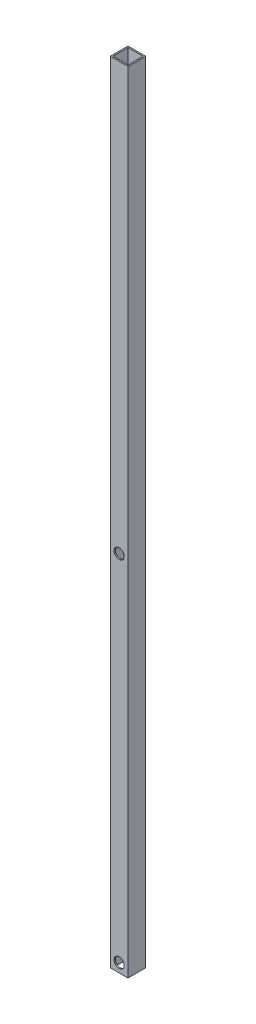
ISO-10303-21;
HEADER;
FILE_DESCRIPTION(('STEP AP214'),'2;1');
FILE_NAME('part.step','',(''),(''),'','','');
FILE_SCHEMA(('AUTOMOTIVE_DESIGN { 1 0 10303 214 1 1 1 1 }'));
ENDSEC;
DATA;
#1=APPLICATION_CONTEXT('core data for automotive mechanical design processes');
#2=APPLICATION_PROTOCOL_DEFINITION('international standard','automotive_design',2000,#1);
#3=PRODUCT_CONTEXT('',#1,'mechanical');
#4=PRODUCT('Part','Part','',(#3));
#5=PRODUCT_RELATED_PRODUCT_CATEGORY('part','',(#4));
#6=PRODUCT_DEFINITION_FORMATION('','',#4);
#7=PRODUCT_DEFINITION_CONTEXT('part definition',#1,'design');
#8=PRODUCT_DEFINITION('design','',#6,#7);
#9=PRODUCT_DEFINITION_SHAPE('','',#8);
#10=(LENGTH_UNIT() NAMED_UNIT(*) SI_UNIT(.MILLI.,.METRE.));
#11=(NAMED_UNIT(*) PLANE_ANGLE_UNIT() SI_UNIT($,.RADIAN.));
#12=(NAMED_UNIT(*) SI_UNIT($,.STERADIAN.) SOLID_ANGLE_UNIT());
#13=UNCERTAINTY_MEASURE_WITH_UNIT(LENGTH_MEASURE(1.E-05),#10,'distance_accuracy_value','');
#14=(GEOMETRIC_REPRESENTATION_CONTEXT(3) GLOBAL_UNCERTAINTY_ASSIGNED_CONTEXT((#13)) GLOBAL_UNIT_ASSIGNED_CONTEXT((#10,
#11,#12)) REPRESENTATION_CONTEXT('',''));
#15=CARTESIAN_POINT('',(0.,0.,0.));
#16=DIRECTION('',(0.,0.,1.));
#17=DIRECTION('',(1.,0.,0.));
#18=AXIS2_PLACEMENT_3D('',#15,#16,#17);
#19=CARTESIAN_POINT('',(0.,1981.2,0.));
#20=DIRECTION('',(0.,-1.,0.));
#21=DIRECTION('',(0.,0.,1.));
#22=AXIS2_PLACEMENT_3D('',#19,#20,#21);
#23=PLANE('',#22);
#24=DIRECTION('',(0.,0.,-1.));
#25=VECTOR('',#24,1.);
#26=CARTESIAN_POINT('',(0.,1981.2,0.));
#27=LINE('',#26,#25);
#28=CARTESIAN_POINT('',(0.,1981.2,44.45));
#29=VERTEX_POINT('',#28);
#30=CARTESIAN_POINT('',(0.,1981.2,0.));
#31=VERTEX_POINT('',#30);
#32=EDGE_CURVE('E140',#29,#31,#27,.T.);
#33=ORIENTED_EDGE('',*,*,#32,.F.);
#34=DIRECTION('',(-1.,0.,0.));
#35=VECTOR('',#34,1.);
#36=CARTESIAN_POINT('',(0.,1981.2,44.45));
#37=LINE('',#36,#35);
#38=CARTESIAN_POINT('',(44.45,1981.2,44.45));
#39=VERTEX_POINT('',#38);
#40=EDGE_CURVE('E150',#39,#29,#37,.T.);
#41=ORIENTED_EDGE('',*,*,#40,.F.);
#42=DIRECTION('',(0.,0.,1.));
#43=VECTOR('',#42,1.);
#44=CARTESIAN_POINT('',(44.45,1981.2,0.));
#45=LINE('',#44,#43);
#46=CARTESIAN_POINT('',(44.45,1981.2,0.));
#47=VERTEX_POINT('',#46);
#48=EDGE_CURVE('E147',#47,#39,#45,.T.);
#49=ORIENTED_EDGE('',*,*,#48,.F.);
#50=DIRECTION('',(1.,0.,0.));
#51=VECTOR('',#50,1.);
#52=CARTESIAN_POINT('',(0.,1981.2,0.));
#53=LINE('',#52,#51);
#54=EDGE_CURVE('E143',#31,#47,#53,.T.);
#55=ORIENTED_EDGE('',*,*,#54,.F.);
#56=EDGE_LOOP('',(#33,#41,#49,#55));
#57=FACE_BOUND('',#56,.T.);
#58=DIRECTION('',(1.,0.,0.));
#59=VECTOR('',#58,1.);
#60=CARTESIAN_POINT('',(3.175,1981.2,3.175));
#61=LINE('',#60,#59);
#62=CARTESIAN_POINT('',(3.175,1981.2,3.175));
#63=VERTEX_POINT('',#62);
#64=CARTESIAN_POINT('',(41.275,1981.2,3.175));
#65=VERTEX_POINT('',#64);
#66=EDGE_CURVE('E104',#63,#65,#61,.T.);
#67=ORIENTED_EDGE('',*,*,#66,.T.);
#68=DIRECTION('',(0.,0.,1.));
#69=VECTOR('',#68,1.);
#70=CARTESIAN_POINT('',(41.275,1981.2,3.175));
#71=LINE('',#70,#69);
#72=CARTESIAN_POINT('',(41.275,1981.2,41.275));
#73=VERTEX_POINT('',#72);
#74=EDGE_CURVE('E113',#65,#73,#71,.T.);
#75=ORIENTED_EDGE('',*,*,#74,.T.);
#76=DIRECTION('',(-1.,0.,0.));
#77=VECTOR('',#76,1.);
#78=CARTESIAN_POINT('',(3.175,1981.2,41.275));
#79=LINE('',#78,#77);
#80=CARTESIAN_POINT('',(3.175,1981.2,41.275));
#81=VERTEX_POINT('',#80);
#82=EDGE_CURVE('E117',#73,#81,#79,.T.);
#83=ORIENTED_EDGE('',*,*,#82,.T.);
#84=DIRECTION('',(0.,0.,-1.));
#85=VECTOR('',#84,1.);
#86=CARTESIAN_POINT('',(3.175,1981.2,3.175));
#87=LINE('',#86,#85);
#88=EDGE_CURVE('E120',#81,#63,#87,.T.);
#89=ORIENTED_EDGE('',*,*,#88,.T.);
#90=EDGE_LOOP('',(#67,#75,#83,#89));
#91=FACE_BOUND('',#90,.T.);
#92=ADVANCED_FACE('F37',(#57,#91),#23,.F.);
#93=CARTESIAN_POINT('',(0.,0.,0.));
#94=DIRECTION('',(0.,-1.,0.));
#95=DIRECTION('',(0.,0.,1.));
#96=AXIS2_PLACEMENT_3D('',#93,#94,#95);
#97=PLANE('',#96);
#98=DIRECTION('',(0.,0.,-1.));
#99=VECTOR('',#98,1.);
#100=CARTESIAN_POINT('',(0.,0.,0.));
#101=LINE('',#100,#99);
#102=CARTESIAN_POINT('',(0.,0.,44.45));
#103=VERTEX_POINT('',#102);
#104=CARTESIAN_POINT('',(0.,0.,0.));
#105=VERTEX_POINT('',#104);
#106=EDGE_CURVE('E109',#103,#105,#101,.T.);
#107=ORIENTED_EDGE('',*,*,#106,.T.);
#108=DIRECTION('',(1.,0.,0.));
#109=VECTOR('',#108,1.);
#110=CARTESIAN_POINT('',(0.,0.,0.));
#111=LINE('',#110,#109);
#112=CARTESIAN_POINT('',(44.45,0.,0.));
#113=VERTEX_POINT('',#112);
#114=EDGE_CURVE('E156',#105,#113,#111,.T.);
#115=ORIENTED_EDGE('',*,*,#114,.T.);
#116=DIRECTION('',(0.,0.,1.));
#117=VECTOR('',#116,1.);
#118=CARTESIAN_POINT('',(44.45,0.,0.));
#119=LINE('',#118,#117);
#120=CARTESIAN_POINT('',(44.45,0.,44.45));
#121=VERTEX_POINT('',#120);
#122=EDGE_CURVE('E159',#113,#121,#119,.T.);
#123=ORIENTED_EDGE('',*,*,#122,.T.);
#124=DIRECTION('',(-1.,0.,0.));
#125=VECTOR('',#124,1.);
#126=CARTESIAN_POINT('',(0.,0.,44.45));
#127=LINE('',#126,#125);
#128=EDGE_CURVE('E144',#121,#103,#127,.T.);
#129=ORIENTED_EDGE('',*,*,#128,.T.);
#130=EDGE_LOOP('',(#107,#115,#123,#129));
#131=FACE_BOUND('',#130,.T.);
#132=DIRECTION('',(0.,0.,-1.));
#133=VECTOR('',#132,1.);
#134=CARTESIAN_POINT('',(3.175,0.,3.175));
#135=LINE('',#134,#133);
#136=CARTESIAN_POINT('',(3.175,0.,41.275));
#137=VERTEX_POINT('',#136);
#138=CARTESIAN_POINT('',(3.175,0.,3.175));
#139=VERTEX_POINT('',#138);
#140=EDGE_CURVE('E121',#137,#139,#135,.T.);
#141=ORIENTED_EDGE('',*,*,#140,.F.);
#142=DIRECTION('',(-1.,0.,0.));
#143=VECTOR('',#142,1.);
#144=CARTESIAN_POINT('',(3.175,0.,41.275));
#145=LINE('',#144,#143);
#146=CARTESIAN_POINT('',(41.275,0.,41.275));
#147=VERTEX_POINT('',#146);
#148=EDGE_CURVE('E124',#147,#137,#145,.T.);
#149=ORIENTED_EDGE('',*,*,#148,.F.);
#150=DIRECTION('',(0.,0.,1.));
#151=VECTOR('',#150,1.);
#152=CARTESIAN_POINT('',(41.275,0.,3.175));
#153=LINE('',#152,#151);
#154=CARTESIAN_POINT('',(41.275,0.,3.175));
#155=VERTEX_POINT('',#154);
#156=EDGE_CURVE('E133',#155,#147,#153,.T.);
#157=ORIENTED_EDGE('',*,*,#156,.F.);
#158=DIRECTION('',(1.,0.,0.));
#159=VECTOR('',#158,1.);
#160=CARTESIAN_POINT('',(3.175,0.,3.175));
#161=LINE('',#160,#159);
#162=EDGE_CURVE('E105',#139,#155,#161,.T.);
#163=ORIENTED_EDGE('',*,*,#162,.F.);
#164=EDGE_LOOP('',(#141,#149,#157,#163));
#165=FACE_BOUND('',#164,.T.);
#166=ADVANCED_FACE('F176',(#131,#165),#97,.T.);
#167=CARTESIAN_POINT('',(0.,1981.2,0.));
#168=DIRECTION('',(1.,0.,0.));
#169=DIRECTION('',(0.,0.,1.));
#170=AXIS2_PLACEMENT_3D('',#167,#168,#169);
#171=PLANE('',#170);
#172=ORIENTED_EDGE('',*,*,#106,.F.);
#173=DIRECTION('',(0.,-1.,0.));
#174=VECTOR('',#173,1.);
#175=CARTESIAN_POINT('',(0.,1981.2,44.45));
#176=LINE('',#175,#174);
#177=EDGE_CURVE('E153',#29,#103,#176,.T.);
#178=ORIENTED_EDGE('',*,*,#177,.F.);
#179=ORIENTED_EDGE('',*,*,#32,.T.);
#180=DIRECTION('',(0.,-1.,0.));
#181=VECTOR('',#180,1.);
#182=CARTESIAN_POINT('',(0.,1981.2,0.));
#183=LINE('',#182,#181);
#184=EDGE_CURVE('E11',#31,#105,#183,.T.);
#185=ORIENTED_EDGE('',*,*,#184,.T.);
#186=EDGE_LOOP('',(#172,#178,#179,#185));
#187=FACE_BOUND('',#186,.T.);
#188=ADVANCED_FACE('F39',(#187),#171,.F.);
#189=CARTESIAN_POINT('',(0.,1981.2,0.));
#190=DIRECTION('',(0.,0.,1.));
#191=DIRECTION('',(-1.,0.,0.));
#192=AXIS2_PLACEMENT_3D('',#189,#190,#191);
#193=PLANE('',#192);
#194=CARTESIAN_POINT('',(22.225,22.225,0.));
#195=DIRECTION('',(0.,0.,1.));
#196=DIRECTION('',(1.,0.,0.));
#197=AXIS2_PLACEMENT_3D('',#194,#195,#196);
#198=CIRCLE('',#197,18.25625);
#199=CARTESIAN_POINT('',(40.48125,22.225,0.));
#200=VERTEX_POINT('',#199);
#201=EDGE_CURVE('E134',#200,#200,#198,.T.);
#202=ORIENTED_EDGE('',*,*,#201,.T.);
#203=EDGE_LOOP('',(#202));
#204=FACE_BOUND('',#203,.T.);
#205=CARTESIAN_POINT('',(22.225,911.225,0.));
#206=DIRECTION('',(0.,0.,1.));
#207=DIRECTION('',(1.,0.,0.));
#208=AXIS2_PLACEMENT_3D('',#205,#206,#207);
#209=CIRCLE('',#208,18.25625);
#210=CARTESIAN_POINT('',(40.48125,911.225,0.));
#211=VERTEX_POINT('',#210);
#212=EDGE_CURVE('E127',#211,#211,#209,.T.);
#213=ORIENTED_EDGE('',*,*,#212,.T.);
#214=EDGE_LOOP('',(#213));
#215=FACE_BOUND('',#214,.T.);
#216=ORIENTED_EDGE('',*,*,#114,.F.);
#217=ORIENTED_EDGE('',*,*,#184,.F.);
#218=ORIENTED_EDGE('',*,*,#54,.T.);
#219=DIRECTION('',(0.,-1.,0.));
#220=VECTOR('',#219,1.);
#221=CARTESIAN_POINT('',(44.45,1981.2,0.));
#222=LINE('',#221,#220);
#223=EDGE_CURVE('E45',#47,#113,#222,.T.);
#224=ORIENTED_EDGE('',*,*,#223,.T.);
#225=EDGE_LOOP('',(#216,#217,#218,#224));
#226=FACE_BOUND('',#225,.T.);
#227=ADVANCED_FACE('F169',(#204,#215,#226),#193,.F.);
#228=CARTESIAN_POINT('',(44.45,1981.2,0.));
#229=DIRECTION('',(-1.,0.,0.));
#230=DIRECTION('',(0.,0.,-1.));
#231=AXIS2_PLACEMENT_3D('',#228,#229,#230);
#232=PLANE('',#231);
#233=ORIENTED_EDGE('',*,*,#122,.F.);
#234=ORIENTED_EDGE('',*,*,#223,.F.);
#235=ORIENTED_EDGE('',*,*,#48,.T.);
#236=DIRECTION('',(0.,-1.,0.));
#237=VECTOR('',#236,1.);
#238=CARTESIAN_POINT('',(44.45,1981.2,44.45));
#239=LINE('',#238,#237);
#240=EDGE_CURVE('E165',#39,#121,#239,.T.);
#241=ORIENTED_EDGE('',*,*,#240,.T.);
#242=EDGE_LOOP('',(#233,#234,#235,#241));
#243=FACE_BOUND('',#242,.T.);
#244=ADVANCED_FACE('F173',(#243),#232,.F.);
#245=CARTESIAN_POINT('',(0.,1981.2,44.45));
#246=DIRECTION('',(0.,0.,-1.));
#247=DIRECTION('',(1.,0.,0.));
#248=AXIS2_PLACEMENT_3D('',#245,#246,#247);
#249=PLANE('',#248);
#250=CARTESIAN_POINT('',(22.225,911.225,44.45));
#251=DIRECTION('',(0.,0.,-1.));
#252=DIRECTION('',(-1.,0.,0.));
#253=AXIS2_PLACEMENT_3D('',#250,#251,#252);
#254=CIRCLE('',#253,12.7);
#255=CARTESIAN_POINT('',(9.525,911.225,44.45));
#256=VERTEX_POINT('',#255);
#257=EDGE_CURVE('E236',#256,#256,#254,.T.);
#258=ORIENTED_EDGE('',*,*,#257,.T.);
#259=EDGE_LOOP('',(#258));
#260=FACE_BOUND('',#259,.T.);
#261=CARTESIAN_POINT('',(22.225,22.225,44.45));
#262=DIRECTION('',(0.,0.,-1.));
#263=DIRECTION('',(-1.,0.,0.));
#264=AXIS2_PLACEMENT_3D('',#261,#262,#263);
#265=CIRCLE('',#264,12.7);
#266=CARTESIAN_POINT('',(9.525,22.225,44.45));
#267=VERTEX_POINT('',#266);
#268=EDGE_CURVE('E240',#267,#267,#265,.T.);
#269=ORIENTED_EDGE('',*,*,#268,.T.);
#270=EDGE_LOOP('',(#269));
#271=FACE_BOUND('',#270,.T.);
#272=ORIENTED_EDGE('',*,*,#128,.F.);
#273=ORIENTED_EDGE('',*,*,#240,.F.);
#274=ORIENTED_EDGE('',*,*,#40,.T.);
#275=ORIENTED_EDGE('',*,*,#177,.T.);
#276=EDGE_LOOP('',(#272,#273,#274,#275));
#277=FACE_BOUND('',#276,.T.);
#278=ADVANCED_FACE('F184',(#260,#271,#277),#249,.F.);
#279=CARTESIAN_POINT('',(3.175,1981.2,3.175));
#280=DIRECTION('',(0.,0.,1.));
#281=DIRECTION('',(-1.,0.,0.));
#282=AXIS2_PLACEMENT_3D('',#279,#280,#281);
#283=PLANE('',#282);
#284=CARTESIAN_POINT('',(22.225,22.225,3.175));
#285=DIRECTION('',(0.,0.,-1.));
#286=DIRECTION('',(-1.,0.,0.));
#287=AXIS2_PLACEMENT_3D('',#284,#285,#286);
#288=CIRCLE('',#287,18.25625);
#289=CARTESIAN_POINT('',(3.96875,22.225,3.175));
#290=VERTEX_POINT('',#289);
#291=EDGE_CURVE('E248',#290,#290,#288,.F.);
#292=ORIENTED_EDGE('',*,*,#291,.F.);
#293=EDGE_LOOP('',(#292));
#294=FACE_BOUND('',#293,.T.);
#295=CARTESIAN_POINT('',(22.225,911.225,3.175));
#296=DIRECTION('',(0.,0.,-1.));
#297=DIRECTION('',(-1.,0.,0.));
#298=AXIS2_PLACEMENT_3D('',#295,#296,#297);
#299=CIRCLE('',#298,18.25625);
#300=CARTESIAN_POINT('',(3.96875,911.225,3.175));
#301=VERTEX_POINT('',#300);
#302=EDGE_CURVE('E237',#301,#301,#299,.F.);
#303=ORIENTED_EDGE('',*,*,#302,.F.);
#304=EDGE_LOOP('',(#303));
#305=FACE_BOUND('',#304,.T.);
#306=ORIENTED_EDGE('',*,*,#162,.T.);
#307=DIRECTION('',(0.,-1.,0.));
#308=VECTOR('',#307,1.);
#309=CARTESIAN_POINT('',(41.275,1981.2,3.175));
#310=LINE('',#309,#308);
#311=EDGE_CURVE('E100',#65,#155,#310,.T.);
#312=ORIENTED_EDGE('',*,*,#311,.F.);
#313=ORIENTED_EDGE('',*,*,#66,.F.);
#314=DIRECTION('',(0.,-1.,0.));
#315=VECTOR('',#314,1.);
#316=CARTESIAN_POINT('',(3.175,1981.2,3.175));
#317=LINE('',#316,#315);
#318=EDGE_CURVE('E60',#63,#139,#317,.T.);
#319=ORIENTED_EDGE('',*,*,#318,.T.);
#320=EDGE_LOOP('',(#306,#312,#313,#319));
#321=FACE_BOUND('',#320,.T.);
#322=ADVANCED_FACE('F102',(#294,#305,#321),#283,.T.);
#323=CARTESIAN_POINT('',(41.275,1981.2,3.175));
#324=DIRECTION('',(-1.,0.,0.));
#325=DIRECTION('',(0.,0.,-1.));
#326=AXIS2_PLACEMENT_3D('',#323,#324,#325);
#327=PLANE('',#326);
#328=ORIENTED_EDGE('',*,*,#156,.T.);
#329=DIRECTION('',(0.,-1.,0.));
#330=VECTOR('',#329,1.);
#331=CARTESIAN_POINT('',(41.275,1981.2,41.275));
#332=LINE('',#331,#330);
#333=EDGE_CURVE('E110',#73,#147,#332,.T.);
#334=ORIENTED_EDGE('',*,*,#333,.F.);
#335=ORIENTED_EDGE('',*,*,#74,.F.);
#336=ORIENTED_EDGE('',*,*,#311,.T.);
#337=EDGE_LOOP('',(#328,#334,#335,#336));
#338=FACE_BOUND('',#337,.T.);
#339=ADVANCED_FACE('F114',(#338),#327,.T.);
#340=CARTESIAN_POINT('',(3.175,1981.2,41.275));
#341=DIRECTION('',(0.,0.,-1.));
#342=DIRECTION('',(1.,0.,0.));
#343=AXIS2_PLACEMENT_3D('',#340,#341,#342);
#344=PLANE('',#343);
#345=CARTESIAN_POINT('',(22.225,911.225,41.275));
#346=DIRECTION('',(0.,0.,1.));
#347=DIRECTION('',(1.,0.,0.));
#348=AXIS2_PLACEMENT_3D('',#345,#346,#347);
#349=CIRCLE('',#348,12.7);
#350=CARTESIAN_POINT('',(34.925,911.225,41.275));
#351=VERTEX_POINT('',#350);
#352=EDGE_CURVE('E234',#351,#351,#349,.F.);
#353=ORIENTED_EDGE('',*,*,#352,.F.);
#354=EDGE_LOOP('',(#353));
#355=FACE_BOUND('',#354,.T.);
#356=CARTESIAN_POINT('',(22.225,22.225,41.275));
#357=DIRECTION('',(0.,0.,1.));
#358=DIRECTION('',(1.,0.,0.));
#359=AXIS2_PLACEMENT_3D('',#356,#357,#358);
#360=CIRCLE('',#359,12.7);
#361=CARTESIAN_POINT('',(34.925,22.225,41.275));
#362=VERTEX_POINT('',#361);
#363=EDGE_CURVE('E245',#362,#362,#360,.F.);
#364=ORIENTED_EDGE('',*,*,#363,.F.);
#365=EDGE_LOOP('',(#364));
#366=FACE_BOUND('',#365,.T.);
#367=ORIENTED_EDGE('',*,*,#148,.T.);
#368=DIRECTION('',(0.,-1.,0.));
#369=VECTOR('',#368,1.);
#370=CARTESIAN_POINT('',(3.175,1981.2,41.275));
#371=LINE('',#370,#369);
#372=EDGE_CURVE('E52',#81,#137,#371,.T.);
#373=ORIENTED_EDGE('',*,*,#372,.F.);
#374=ORIENTED_EDGE('',*,*,#82,.F.);
#375=ORIENTED_EDGE('',*,*,#333,.T.);
#376=EDGE_LOOP('',(#367,#373,#374,#375));
#377=FACE_BOUND('',#376,.T.);
#378=ADVANCED_FACE('F206',(#355,#366,#377),#344,.T.);
#379=CARTESIAN_POINT('',(3.175,1981.2,3.175));
#380=DIRECTION('',(1.,0.,0.));
#381=DIRECTION('',(0.,0.,1.));
#382=AXIS2_PLACEMENT_3D('',#379,#380,#381);
#383=PLANE('',#382);
#384=ORIENTED_EDGE('',*,*,#140,.T.);
#385=ORIENTED_EDGE('',*,*,#318,.F.);
#386=ORIENTED_EDGE('',*,*,#88,.F.);
#387=ORIENTED_EDGE('',*,*,#372,.T.);
#388=EDGE_LOOP('',(#384,#385,#386,#387));
#389=FACE_BOUND('',#388,.T.);
#390=ADVANCED_FACE('F209',(#389),#383,.T.);
#391=CARTESIAN_POINT('',(22.225,911.225,44.451));
#392=DIRECTION('',(0.,0.,-1.));
#393=DIRECTION('',(1.,0.,0.));
#394=AXIS2_PLACEMENT_3D('',#391,#392,#393);
#395=CYLINDRICAL_SURFACE('',#394,18.25625);
#396=ORIENTED_EDGE('',*,*,#302,.T.);
#397=EDGE_LOOP('',(#396));
#398=FACE_BOUND('',#397,.T.);
#399=ORIENTED_EDGE('',*,*,#212,.F.);
#400=EDGE_LOOP('',(#399));
#401=FACE_BOUND('',#400,.T.);
#402=ADVANCED_FACE('F213',(#398,#401),#395,.F.);
#403=CARTESIAN_POINT('',(22.225,22.225,44.451));
#404=DIRECTION('',(0.,0.,-1.));
#405=DIRECTION('',(1.,0.,0.));
#406=AXIS2_PLACEMENT_3D('',#403,#404,#405);
#407=CYLINDRICAL_SURFACE('',#406,18.25625);
#408=ORIENTED_EDGE('',*,*,#291,.T.);
#409=EDGE_LOOP('',(#408));
#410=FACE_BOUND('',#409,.T.);
#411=ORIENTED_EDGE('',*,*,#201,.F.);
#412=EDGE_LOOP('',(#411));
#413=FACE_BOUND('',#412,.T.);
#414=ADVANCED_FACE('F217',(#410,#413),#407,.F.);
#415=CARTESIAN_POINT('',(22.225,22.225,-0.001000000000001));
#416=DIRECTION('',(0.,0.,1.));
#417=DIRECTION('',(-1.,0.,0.));
#418=AXIS2_PLACEMENT_3D('',#415,#416,#417);
#419=CYLINDRICAL_SURFACE('',#418,12.7);
#420=ORIENTED_EDGE('',*,*,#363,.T.);
#421=EDGE_LOOP('',(#420));
#422=FACE_BOUND('',#421,.T.);
#423=ORIENTED_EDGE('',*,*,#268,.F.);
#424=EDGE_LOOP('',(#423));
#425=FACE_BOUND('',#424,.T.);
#426=ADVANCED_FACE('F221',(#422,#425),#419,.F.);
#427=CARTESIAN_POINT('',(22.225,911.225,-0.001000000000001));
#428=DIRECTION('',(0.,0.,1.));
#429=DIRECTION('',(-1.,0.,0.));
#430=AXIS2_PLACEMENT_3D('',#427,#428,#429);
#431=CYLINDRICAL_SURFACE('',#430,12.7);
#432=ORIENTED_EDGE('',*,*,#352,.T.);
#433=EDGE_LOOP('',(#432));
#434=FACE_BOUND('',#433,.T.);
#435=ORIENTED_EDGE('',*,*,#257,.F.);
#436=EDGE_LOOP('',(#435));
#437=FACE_BOUND('',#436,.T.);
#438=ADVANCED_FACE('F225',(#434,#437),#431,.F.);
#439=CLOSED_SHELL('',(#92,#166,#188,#227,#244,#278,#322,#339,#378,#390,#402,#414,#426,#438));
#440=MANIFOLD_SOLID_BREP('B2',#439);
#441=ADVANCED_BREP_SHAPE_REPRESENTATION('',(#18,#440),#14);
#442=SHAPE_DEFINITION_REPRESENTATION(#9,#441);
ENDSEC;
END-ISO-10303-21;
